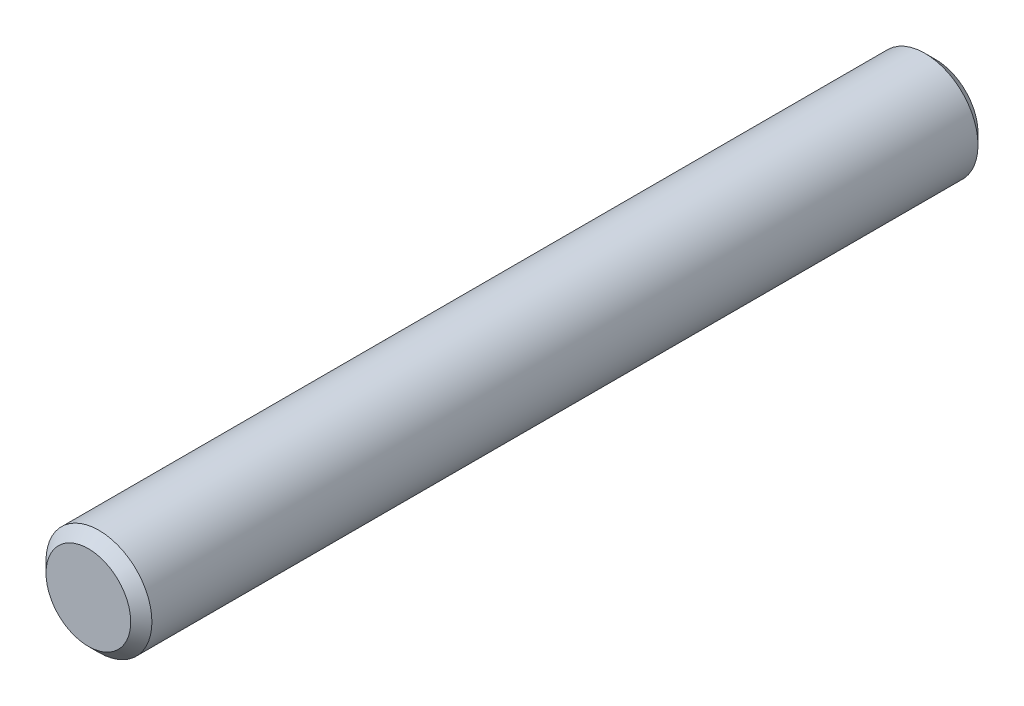
ISO-10303-21;
HEADER;
FILE_DESCRIPTION(('STEP AP214'),'2;1');
FILE_NAME('part.step','',(''),(''),'','','');
FILE_SCHEMA(('AUTOMOTIVE_DESIGN { 1 0 10303 214 1 1 1 1 }'));
ENDSEC;
DATA;
#1=APPLICATION_CONTEXT('core data for automotive mechanical design processes');
#2=APPLICATION_PROTOCOL_DEFINITION('international standard','automotive_design',2000,#1);
#3=PRODUCT_CONTEXT('',#1,'mechanical');
#4=PRODUCT('Part','Part','',(#3));
#5=PRODUCT_RELATED_PRODUCT_CATEGORY('part','',(#4));
#6=PRODUCT_DEFINITION_FORMATION('','',#4);
#7=PRODUCT_DEFINITION_CONTEXT('part definition',#1,'design');
#8=PRODUCT_DEFINITION('design','',#6,#7);
#9=PRODUCT_DEFINITION_SHAPE('','',#8);
#10=(LENGTH_UNIT() NAMED_UNIT(*) SI_UNIT(.MILLI.,.METRE.));
#11=(NAMED_UNIT(*) PLANE_ANGLE_UNIT() SI_UNIT($,.RADIAN.));
#12=(NAMED_UNIT(*) SI_UNIT($,.STERADIAN.) SOLID_ANGLE_UNIT());
#13=UNCERTAINTY_MEASURE_WITH_UNIT(LENGTH_MEASURE(1.E-05),#10,'distance_accuracy_value','');
#14=(GEOMETRIC_REPRESENTATION_CONTEXT(3) GLOBAL_UNCERTAINTY_ASSIGNED_CONTEXT((#13)) GLOBAL_UNIT_ASSIGNED_CONTEXT((#10,
#11,#12)) REPRESENTATION_CONTEXT('',''));
#15=CARTESIAN_POINT('',(0.,0.,0.));
#16=DIRECTION('',(0.,0.,1.));
#17=DIRECTION('',(1.,0.,0.));
#18=AXIS2_PLACEMENT_3D('',#15,#16,#17);
#19=CARTESIAN_POINT('',(0.,0.,-12.));
#20=DIRECTION('',(0.,0.,1.));
#21=DIRECTION('',(1.,0.,0.));
#22=AXIS2_PLACEMENT_3D('',#19,#20,#21);
#23=PLANE('',#22);
#24=CARTESIAN_POINT('',(0.,0.,-12.0000000000573));
#25=DIRECTION('',(0.,0.,1.));
#26=DIRECTION('',(1.,0.,0.));
#27=AXIS2_PLACEMENT_3D('',#24,#25,#26);
#28=CIRCLE('',#27,1.19999999998299);
#29=CARTESIAN_POINT('',(1.19999999998299,0.,-12.0000000000573));
#30=VERTEX_POINT('',#29);
#31=EDGE_CURVE('E18',#30,#30,#28,.T.);
#32=ORIENTED_EDGE('',*,*,#31,.F.);
#33=EDGE_LOOP('',(#32));
#34=FACE_BOUND('',#33,.T.);
#35=ADVANCED_FACE('F15',(#34),#23,.F.);
#36=CARTESIAN_POINT('',(0.,0.,12.));
#37=DIRECTION('',(0.,0.,1.));
#38=DIRECTION('',(1.,0.,0.));
#39=AXIS2_PLACEMENT_3D('',#36,#37,#38);
#40=PLANE('',#39);
#41=CARTESIAN_POINT('',(0.,0.,12.0000000000573));
#42=DIRECTION('',(0.,0.,-1.));
#43=DIRECTION('',(-1.,0.,0.));
#44=AXIS2_PLACEMENT_3D('',#41,#42,#43);
#45=CIRCLE('',#44,1.20000000003984);
#46=CARTESIAN_POINT('',(-1.20000000003984,0.,12.0000000000573));
#47=VERTEX_POINT('',#46);
#48=EDGE_CURVE('E27',#47,#47,#45,.T.);
#49=ORIENTED_EDGE('',*,*,#48,.F.);
#50=EDGE_LOOP('',(#49));
#51=FACE_BOUND('',#50,.T.);
#52=ADVANCED_FACE('F42',(#51),#40,.T.);
#53=CARTESIAN_POINT('',(0.,0.,-11.7000000000189));
#54=DIRECTION('',(0.,0.,1.));
#55=DIRECTION('',(1.,0.,0.));
#56=AXIS2_PLACEMENT_3D('',#53,#54,#55);
#57=CONICAL_SURFACE('',#56,1.50000000002137,0.785398163397448);
#58=CARTESIAN_POINT('',(0.,0.,-11.7));
#59=DIRECTION('',(0.,0.,1.));
#60=DIRECTION('',(1.,0.,0.));
#61=AXIS2_PLACEMENT_3D('',#58,#59,#60);
#62=CIRCLE('',#61,1.5);
#63=CARTESIAN_POINT('',(1.5,0.,-11.7));
#64=VERTEX_POINT('',#63);
#65=EDGE_CURVE('E22',#64,#64,#62,.T.);
#66=ORIENTED_EDGE('',*,*,#65,.F.);
#67=EDGE_LOOP('',(#66));
#68=FACE_BOUND('',#67,.T.);
#69=ORIENTED_EDGE('',*,*,#31,.T.);
#70=EDGE_LOOP('',(#69));
#71=FACE_BOUND('',#70,.T.);
#72=ADVANCED_FACE('F39',(#68,#71),#57,.T.);
#73=CARTESIAN_POINT('',(0.,0.,11.7000000001326));
#74=DIRECTION('',(0.,0.,-1.));
#75=DIRECTION('',(-1.,0.,0.));
#76=AXIS2_PLACEMENT_3D('',#73,#74,#75);
#77=CONICAL_SURFACE('',#76,1.50000000002137,0.785398163492187);
#78=CARTESIAN_POINT('',(0.,0.,11.7));
#79=DIRECTION('',(0.,0.,1.));
#80=DIRECTION('',(1.,0.,0.));
#81=AXIS2_PLACEMENT_3D('',#78,#79,#80);
#82=CIRCLE('',#81,1.5);
#83=CARTESIAN_POINT('',(1.5,0.,11.7));
#84=VERTEX_POINT('',#83);
#85=EDGE_CURVE('E10',#84,#84,#82,.F.);
#86=ORIENTED_EDGE('',*,*,#85,.F.);
#87=EDGE_LOOP('',(#86));
#88=FACE_BOUND('',#87,.T.);
#89=ORIENTED_EDGE('',*,*,#48,.T.);
#90=EDGE_LOOP('',(#89));
#91=FACE_BOUND('',#90,.T.);
#92=ADVANCED_FACE('F50',(#88,#91),#77,.T.);
#93=CARTESIAN_POINT('',(0.,0.,-12.));
#94=DIRECTION('',(0.,0.,1.));
#95=DIRECTION('',(1.,0.,0.));
#96=AXIS2_PLACEMENT_3D('',#93,#94,#95);
#97=CYLINDRICAL_SURFACE('',#96,1.5);
#98=ORIENTED_EDGE('',*,*,#85,.T.);
#99=EDGE_LOOP('',(#98));
#100=FACE_BOUND('',#99,.T.);
#101=ORIENTED_EDGE('',*,*,#65,.T.);
#102=EDGE_LOOP('',(#101));
#103=FACE_BOUND('',#102,.T.);
#104=ADVANCED_FACE('F48',(#100,#103),#97,.T.);
#105=CLOSED_SHELL('',(#35,#52,#72,#92,#104));
#106=MANIFOLD_SOLID_BREP('B1',#105);
#107=ADVANCED_BREP_SHAPE_REPRESENTATION('',(#18,#106),#14);
#108=SHAPE_DEFINITION_REPRESENTATION(#9,#107);
ENDSEC;
END-ISO-10303-21;
